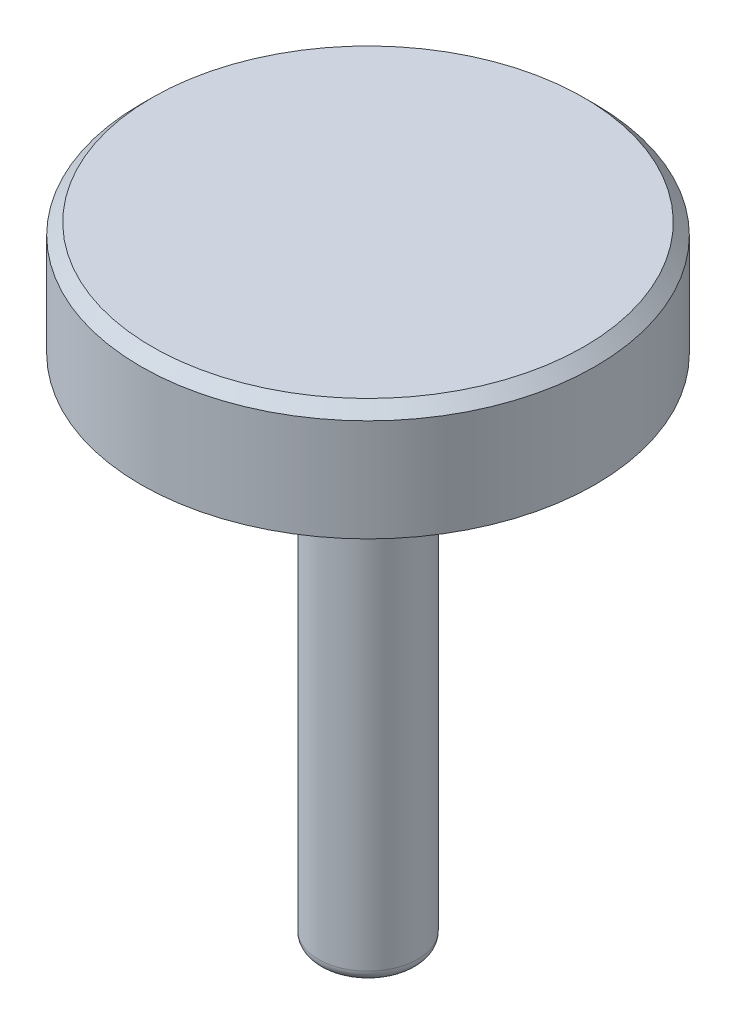
ISO-10303-21;
HEADER;
FILE_DESCRIPTION(('STEP AP214'),'2;1');
FILE_NAME('part.step','',(''),(''),'','','');
FILE_SCHEMA(('AUTOMOTIVE_DESIGN { 1 0 10303 214 1 1 1 1 }'));
ENDSEC;
DATA;
#1=APPLICATION_CONTEXT('core data for automotive mechanical design processes');
#2=APPLICATION_PROTOCOL_DEFINITION('international standard','automotive_design',2000,#1);
#3=PRODUCT_CONTEXT('',#1,'mechanical');
#4=PRODUCT('Part','Part','',(#3));
#5=PRODUCT_RELATED_PRODUCT_CATEGORY('part','',(#4));
#6=PRODUCT_DEFINITION_FORMATION('','',#4);
#7=PRODUCT_DEFINITION_CONTEXT('part definition',#1,'design');
#8=PRODUCT_DEFINITION('design','',#6,#7);
#9=PRODUCT_DEFINITION_SHAPE('','',#8);
#10=(LENGTH_UNIT() NAMED_UNIT(*) SI_UNIT(.MILLI.,.METRE.));
#11=(NAMED_UNIT(*) PLANE_ANGLE_UNIT() SI_UNIT($,.RADIAN.));
#12=(NAMED_UNIT(*) SI_UNIT($,.STERADIAN.) SOLID_ANGLE_UNIT());
#13=UNCERTAINTY_MEASURE_WITH_UNIT(LENGTH_MEASURE(1.E-05),#10,'distance_accuracy_value','');
#14=(GEOMETRIC_REPRESENTATION_CONTEXT(3) GLOBAL_UNCERTAINTY_ASSIGNED_CONTEXT((#13)) GLOBAL_UNIT_ASSIGNED_CONTEXT((#10,
#11,#12)) REPRESENTATION_CONTEXT('',''));
#15=CARTESIAN_POINT('',(0.,0.,0.));
#16=DIRECTION('',(0.,0.,1.));
#17=DIRECTION('',(1.,0.,0.));
#18=AXIS2_PLACEMENT_3D('',#15,#16,#17);
#19=CARTESIAN_POINT('',(0.,0.,0.));
#20=DIRECTION('',(0.,1.,0.));
#21=DIRECTION('',(-1.,0.,0.));
#22=AXIS2_PLACEMENT_3D('',#19,#20,#21);
#23=PLANE('',#22);
#24=CARTESIAN_POINT('',(0.,0.,0.));
#25=DIRECTION('',(0.,1.,0.));
#26=DIRECTION('',(-1.,0.,0.));
#27=AXIS2_PLACEMENT_3D('',#24,#25,#26);
#28=CIRCLE('',#27,0.675000000000001);
#29=CARTESIAN_POINT('',(-0.675000000000001,0.,0.));
#30=VERTEX_POINT('',#29);
#31=EDGE_CURVE('E48',#30,#30,#28,.F.);
#32=ORIENTED_EDGE('',*,*,#31,.T.);
#33=EDGE_LOOP('',(#32));
#34=FACE_BOUND('',#33,.T.);
#35=ADVANCED_FACE('F36',(#34),#23,.F.);
#36=CARTESIAN_POINT('',(0.,11.,0.));
#37=DIRECTION('',(0.,1.,0.));
#38=DIRECTION('',(-1.,0.,0.));
#39=AXIS2_PLACEMENT_3D('',#36,#37,#38);
#40=CYLINDRICAL_SURFACE('',#39,0.875000000000001);
#41=CARTESIAN_POINT('',(0.,8.8,0.));
#42=DIRECTION('',(0.,1.,0.));
#43=DIRECTION('',(-1.,0.,0.));
#44=AXIS2_PLACEMENT_3D('',#41,#42,#43);
#45=CIRCLE('',#44,0.875000000000001);
#46=CARTESIAN_POINT('',(-0.875000000000003,8.8,0.));
#47=VERTEX_POINT('',#46);
#48=EDGE_CURVE('E52',#47,#47,#45,.F.);
#49=ORIENTED_EDGE('',*,*,#48,.T.);
#50=EDGE_LOOP('',(#49));
#51=FACE_BOUND('',#50,.T.);
#52=CARTESIAN_POINT('',(0.,0.200000000000001,0.));
#53=DIRECTION('',(0.,1.,0.));
#54=DIRECTION('',(-1.,0.,0.));
#55=AXIS2_PLACEMENT_3D('',#52,#53,#54);
#56=CIRCLE('',#55,0.875000000000001);
#57=CARTESIAN_POINT('',(-0.875000000000001,0.2,0.));
#58=VERTEX_POINT('',#57);
#59=EDGE_CURVE('E57',#58,#58,#56,.T.);
#60=ORIENTED_EDGE('',*,*,#59,.T.);
#61=EDGE_LOOP('',(#60));
#62=FACE_BOUND('',#61,.T.);
#63=ADVANCED_FACE('F71',(#51,#62),#40,.T.);
#64=CARTESIAN_POINT('',(0.875,9.,0.));
#65=DIRECTION('',(0.,1.,0.));
#66=DIRECTION('',(-1.,0.,0.));
#67=AXIS2_PLACEMENT_3D('',#64,#65,#66);
#68=PLANE('',#67);
#69=CARTESIAN_POINT('',(0.,9.,0.));
#70=DIRECTION('',(0.,1.,0.));
#71=DIRECTION('',(-1.,0.,0.));
#72=AXIS2_PLACEMENT_3D('',#69,#70,#71);
#73=CIRCLE('',#72,1.075);
#74=CARTESIAN_POINT('',(-1.075,9.,0.));
#75=VERTEX_POINT('',#74);
#76=EDGE_CURVE('E60',#75,#75,#73,.T.);
#77=ORIENTED_EDGE('',*,*,#76,.T.);
#78=EDGE_LOOP('',(#77));
#79=FACE_BOUND('',#78,.T.);
#80=CARTESIAN_POINT('',(0.,9.,0.));
#81=DIRECTION('',(0.,1.,0.));
#82=DIRECTION('',(-1.,0.,0.));
#83=AXIS2_PLACEMENT_3D('',#80,#81,#82);
#84=CIRCLE('',#83,4.);
#85=CARTESIAN_POINT('',(-4.,9.,0.));
#86=VERTEX_POINT('',#85);
#87=EDGE_CURVE('E63',#86,#86,#84,.T.);
#88=ORIENTED_EDGE('',*,*,#87,.F.);
#89=EDGE_LOOP('',(#88));
#90=FACE_BOUND('',#89,.T.);
#91=ADVANCED_FACE('F69',(#79,#90),#68,.F.);
#92=CARTESIAN_POINT('',(0.,11.,0.));
#93=DIRECTION('',(0.,1.,0.));
#94=DIRECTION('',(-1.,0.,0.));
#95=AXIS2_PLACEMENT_3D('',#92,#93,#94);
#96=CYLINDRICAL_SURFACE('',#95,4.);
#97=CARTESIAN_POINT('',(0.,10.8,0.));
#98=DIRECTION('',(0.,-1.,0.));
#99=DIRECTION('',(1.,0.,0.));
#100=AXIS2_PLACEMENT_3D('',#97,#98,#99);
#101=CIRCLE('',#100,4.);
#102=CARTESIAN_POINT('',(4.,10.8,0.));
#103=VERTEX_POINT('',#102);
#104=EDGE_CURVE('E10',#103,#103,#101,.T.);
#105=ORIENTED_EDGE('',*,*,#104,.T.);
#106=EDGE_LOOP('',(#105));
#107=FACE_BOUND('',#106,.T.);
#108=ORIENTED_EDGE('',*,*,#87,.T.);
#109=EDGE_LOOP('',(#108));
#110=FACE_BOUND('',#109,.T.);
#111=ADVANCED_FACE('F67',(#107,#110),#96,.T.);
#112=CARTESIAN_POINT('',(4.,11.,0.));
#113=DIRECTION('',(0.,-1.,0.));
#114=DIRECTION('',(1.,0.,0.));
#115=AXIS2_PLACEMENT_3D('',#112,#113,#114);
#116=PLANE('',#115);
#117=CARTESIAN_POINT('',(0.,11.,0.));
#118=DIRECTION('',(0.,-1.,0.));
#119=DIRECTION('',(1.,0.,0.));
#120=AXIS2_PLACEMENT_3D('',#117,#118,#119);
#121=CIRCLE('',#120,3.8);
#122=CARTESIAN_POINT('',(3.8,11.,0.));
#123=VERTEX_POINT('',#122);
#124=EDGE_CURVE('E44',#123,#123,#121,.F.);
#125=ORIENTED_EDGE('',*,*,#124,.T.);
#126=EDGE_LOOP('',(#125));
#127=FACE_BOUND('',#126,.T.);
#128=ADVANCED_FACE('F78',(#127),#116,.F.);
#129=CARTESIAN_POINT('',(0.,8.8,0.));
#130=DIRECTION('',(0.,1.,0.));
#131=DIRECTION('',(-1.,0.,0.));
#132=AXIS2_PLACEMENT_3D('',#129,#130,#131);
#133=TOROIDAL_SURFACE('',#132,1.075,0.2);
#134=ORIENTED_EDGE('',*,*,#48,.F.);
#135=EDGE_LOOP('',(#134));
#136=FACE_BOUND('',#135,.T.);
#137=ORIENTED_EDGE('',*,*,#76,.F.);
#138=EDGE_LOOP('',(#137));
#139=FACE_BOUND('',#138,.T.);
#140=ADVANCED_FACE('F88',(#136,#139),#133,.F.);
#141=CARTESIAN_POINT('',(0.,0.200000000000001,0.));
#142=DIRECTION('',(0.,1.,0.));
#143=DIRECTION('',(-1.,0.,0.));
#144=AXIS2_PLACEMENT_3D('',#141,#142,#143);
#145=TOROIDAL_SURFACE('',#144,0.675000000000001,0.2);
#146=ORIENTED_EDGE('',*,*,#31,.F.);
#147=EDGE_LOOP('',(#146));
#148=FACE_BOUND('',#147,.T.);
#149=ORIENTED_EDGE('',*,*,#59,.F.);
#150=EDGE_LOOP('',(#149));
#151=FACE_BOUND('',#150,.T.);
#152=ADVANCED_FACE('F90',(#148,#151),#145,.T.);
#153=CARTESIAN_POINT('',(0.,11.,0.));
#154=DIRECTION('',(0.,-1.,0.));
#155=DIRECTION('',(1.,0.,0.));
#156=AXIS2_PLACEMENT_3D('',#153,#154,#155);
#157=CONICAL_SURFACE('',#156,3.8,0.785398163397446);
#158=ORIENTED_EDGE('',*,*,#104,.F.);
#159=EDGE_LOOP('',(#158));
#160=FACE_BOUND('',#159,.T.);
#161=ORIENTED_EDGE('',*,*,#124,.F.);
#162=EDGE_LOOP('',(#161));
#163=FACE_BOUND('',#162,.T.);
#164=ADVANCED_FACE('F39',(#160,#163),#157,.T.);
#165=CLOSED_SHELL('',(#35,#63,#91,#111,#128,#140,#152,#164));
#166=MANIFOLD_SOLID_BREP('B2',#165);
#167=ADVANCED_BREP_SHAPE_REPRESENTATION('',(#18,#166),#14);
#168=SHAPE_DEFINITION_REPRESENTATION(#9,#167);
ENDSEC;
END-ISO-10303-21;
